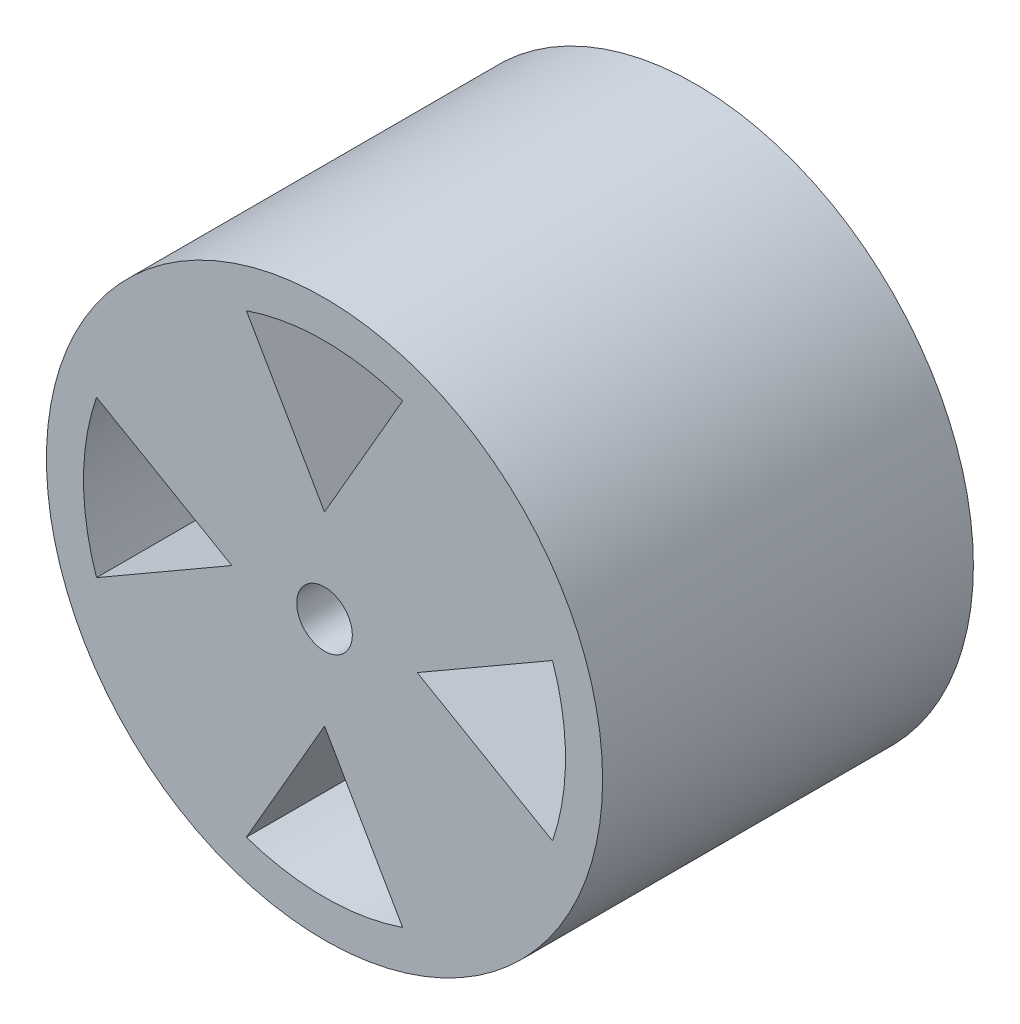
ISO-10303-21;
HEADER;
FILE_DESCRIPTION(('STEP AP214'),'2;1');
FILE_NAME('part.step','',(''),(''),'','','');
FILE_SCHEMA(('AUTOMOTIVE_DESIGN { 1 0 10303 214 1 1 1 1 }'));
ENDSEC;
DATA;
#1=APPLICATION_CONTEXT('core data for automotive mechanical design processes');
#2=APPLICATION_PROTOCOL_DEFINITION('international standard','automotive_design',2000,#1);
#3=PRODUCT_CONTEXT('',#1,'mechanical');
#4=PRODUCT('Part','Part','',(#3));
#5=PRODUCT_RELATED_PRODUCT_CATEGORY('part','',(#4));
#6=PRODUCT_DEFINITION_FORMATION('','',#4);
#7=PRODUCT_DEFINITION_CONTEXT('part definition',#1,'design');
#8=PRODUCT_DEFINITION('design','',#6,#7);
#9=PRODUCT_DEFINITION_SHAPE('','',#8);
#10=(LENGTH_UNIT() NAMED_UNIT(*) SI_UNIT(.MILLI.,.METRE.));
#11=(NAMED_UNIT(*) PLANE_ANGLE_UNIT() SI_UNIT($,.RADIAN.));
#12=(NAMED_UNIT(*) SI_UNIT($,.STERADIAN.) SOLID_ANGLE_UNIT());
#13=UNCERTAINTY_MEASURE_WITH_UNIT(LENGTH_MEASURE(1.E-05),#10,'distance_accuracy_value','');
#14=(GEOMETRIC_REPRESENTATION_CONTEXT(3) GLOBAL_UNCERTAINTY_ASSIGNED_CONTEXT((#13)) GLOBAL_UNIT_ASSIGNED_CONTEXT((#10,
#11,#12)) REPRESENTATION_CONTEXT('',''));
#15=CARTESIAN_POINT('',(0.,0.,0.));
#16=DIRECTION('',(0.,0.,1.));
#17=DIRECTION('',(1.,0.,0.));
#18=AXIS2_PLACEMENT_3D('',#15,#16,#17);
#19=CARTESIAN_POINT('',(0.,0.,10.));
#20=DIRECTION('',(0.,0.,1.));
#21=DIRECTION('',(1.,0.,0.));
#22=AXIS2_PLACEMENT_3D('',#19,#20,#21);
#23=PLANE('',#22);
#24=DIRECTION('',(-0.866025403784438,0.500000000000001,0.));
#25=VECTOR('',#24,1.);
#26=CARTESIAN_POINT('',(-0.625000000000002,-1.08253175473055,10.));
#27=LINE('',#26,#25);
#28=CARTESIAN_POINT('',(-2.5,0.,10.));
#29=VERTEX_POINT('',#28);
#30=CARTESIAN_POINT('',(-6.14909494849609,2.10680595081272,10.));
#31=VERTEX_POINT('',#30);
#32=EDGE_CURVE('E56',#29,#31,#27,.T.);
#33=ORIENTED_EDGE('',*,*,#32,.F.);
#34=DIRECTION('',(-0.866025403784438,-0.500000000000002,0.));
#35=VECTOR('',#34,1.);
#36=CARTESIAN_POINT('',(-0.625000000000004,1.08253175473055,10.));
#37=LINE('',#36,#35);
#38=CARTESIAN_POINT('',(-6.14909494849609,-2.10680595081273,10.));
#39=VERTEX_POINT('',#38);
#40=EDGE_CURVE('E151',#29,#39,#37,.T.);
#41=ORIENTED_EDGE('',*,*,#40,.T.);
#42=CARTESIAN_POINT('',(0.,0.,10.));
#43=DIRECTION('',(0.,0.,1.));
#44=DIRECTION('',(1.,0.,0.));
#45=AXIS2_PLACEMENT_3D('',#42,#43,#44);
#46=CIRCLE('',#45,6.5);
#47=EDGE_CURVE('E156',#31,#39,#46,.T.);
#48=ORIENTED_EDGE('',*,*,#47,.F.);
#49=EDGE_LOOP('',(#33,#41,#48));
#50=FACE_BOUND('',#49,.T.);
#51=DIRECTION('',(0.866025403784438,-0.500000000000001,0.));
#52=VECTOR('',#51,1.);
#53=CARTESIAN_POINT('',(0.625000000000002,1.08253175473055,10.));
#54=LINE('',#53,#52);
#55=CARTESIAN_POINT('',(2.5,0.,10.));
#56=VERTEX_POINT('',#55);
#57=CARTESIAN_POINT('',(6.14909494849609,-2.10680595081272,10.));
#58=VERTEX_POINT('',#57);
#59=EDGE_CURVE('E64',#56,#58,#54,.T.);
#60=ORIENTED_EDGE('',*,*,#59,.F.);
#61=DIRECTION('',(0.866025403784438,0.500000000000002,0.));
#62=VECTOR('',#61,1.);
#63=CARTESIAN_POINT('',(0.625000000000004,-1.08253175473055,10.));
#64=LINE('',#63,#62);
#65=CARTESIAN_POINT('',(6.14909494849609,2.10680595081273,10.));
#66=VERTEX_POINT('',#65);
#67=EDGE_CURVE('E177',#56,#66,#64,.T.);
#68=ORIENTED_EDGE('',*,*,#67,.T.);
#69=CARTESIAN_POINT('',(0.,0.,10.));
#70=DIRECTION('',(0.,0.,1.));
#71=DIRECTION('',(1.,0.,0.));
#72=AXIS2_PLACEMENT_3D('',#69,#70,#71);
#73=CIRCLE('',#72,6.5);
#74=EDGE_CURVE('E188',#58,#66,#73,.T.);
#75=ORIENTED_EDGE('',*,*,#74,.F.);
#76=EDGE_LOOP('',(#60,#68,#75));
#77=FACE_BOUND('',#76,.T.);
#78=CARTESIAN_POINT('',(0.,0.,10.));
#79=DIRECTION('',(0.,0.,1.));
#80=DIRECTION('',(1.,0.,0.));
#81=AXIS2_PLACEMENT_3D('',#78,#79,#80);
#82=CIRCLE('',#81,6.5);
#83=CARTESIAN_POINT('',(-2.10680595081272,-6.14909494849609,10.));
#84=VERTEX_POINT('',#83);
#85=CARTESIAN_POINT('',(2.10680595081273,-6.14909494849609,10.));
#86=VERTEX_POINT('',#85);
#87=EDGE_CURVE('E216',#84,#86,#82,.T.);
#88=ORIENTED_EDGE('',*,*,#87,.F.);
#89=DIRECTION('',(-0.500000000000001,-0.866025403784438,0.));
#90=VECTOR('',#89,1.);
#91=CARTESIAN_POINT('',(1.08253175473055,-0.625000000000002,10.));
#92=LINE('',#91,#90);
#93=CARTESIAN_POINT('',(0.,-2.5,10.));
#94=VERTEX_POINT('',#93);
#95=EDGE_CURVE('E208',#94,#84,#92,.T.);
#96=ORIENTED_EDGE('',*,*,#95,.F.);
#97=DIRECTION('',(0.500000000000002,-0.866025403784438,0.));
#98=VECTOR('',#97,1.);
#99=CARTESIAN_POINT('',(-1.08253175473055,-0.625000000000004,10.));
#100=LINE('',#99,#98);
#101=EDGE_CURVE('E219',#94,#86,#100,.T.);
#102=ORIENTED_EDGE('',*,*,#101,.T.);
#103=EDGE_LOOP('',(#88,#96,#102));
#104=FACE_BOUND('',#103,.T.);
#105=DIRECTION('',(0.500000000000001,0.866025403784438,0.));
#106=VECTOR('',#105,1.);
#107=CARTESIAN_POINT('',(-1.08253175473055,0.625000000000002,10.));
#108=LINE('',#107,#106);
#109=CARTESIAN_POINT('',(0.,2.5,10.));
#110=VERTEX_POINT('',#109);
#111=CARTESIAN_POINT('',(2.10680595081272,6.14909494849609,10.));
#112=VERTEX_POINT('',#111);
#113=EDGE_CURVE('E249',#110,#112,#108,.T.);
#114=ORIENTED_EDGE('',*,*,#113,.F.);
#115=DIRECTION('',(-0.500000000000002,0.866025403784438,0.));
#116=VECTOR('',#115,1.);
#117=CARTESIAN_POINT('',(1.08253175473055,0.625000000000004,10.));
#118=LINE('',#117,#116);
#119=CARTESIAN_POINT('',(-2.10680595081273,6.14909494849609,10.));
#120=VERTEX_POINT('',#119);
#121=EDGE_CURVE('E240',#110,#120,#118,.T.);
#122=ORIENTED_EDGE('',*,*,#121,.T.);
#123=CARTESIAN_POINT('',(0.,0.,10.));
#124=DIRECTION('',(0.,0.,1.));
#125=DIRECTION('',(1.,0.,0.));
#126=AXIS2_PLACEMENT_3D('',#123,#124,#125);
#127=CIRCLE('',#126,6.5);
#128=EDGE_CURVE('E252',#112,#120,#127,.T.);
#129=ORIENTED_EDGE('',*,*,#128,.F.);
#130=EDGE_LOOP('',(#114,#122,#129));
#131=FACE_BOUND('',#130,.T.);
#132=CARTESIAN_POINT('',(0.,0.,10.));
#133=DIRECTION('',(0.,0.,1.));
#134=DIRECTION('',(1.,0.,0.));
#135=AXIS2_PLACEMENT_3D('',#132,#133,#134);
#136=CIRCLE('',#135,7.5);
#137=CARTESIAN_POINT('',(7.5,0.,10.));
#138=VERTEX_POINT('',#137);
#139=EDGE_CURVE('E11',#138,#138,#136,.T.);
#140=ORIENTED_EDGE('',*,*,#139,.T.);
#141=EDGE_LOOP('',(#140));
#142=FACE_BOUND('',#141,.T.);
#143=CARTESIAN_POINT('',(0.,0.,10.));
#144=DIRECTION('',(0.,0.,1.));
#145=DIRECTION('',(1.,0.,0.));
#146=AXIS2_PLACEMENT_3D('',#143,#144,#145);
#147=CIRCLE('',#146,0.75);
#148=CARTESIAN_POINT('',(0.75,0.,10.));
#149=VERTEX_POINT('',#148);
#150=EDGE_CURVE('E267',#149,#149,#147,.T.);
#151=ORIENTED_EDGE('',*,*,#150,.F.);
#152=EDGE_LOOP('',(#151));
#153=FACE_BOUND('',#152,.T.);
#154=ADVANCED_FACE('F40',(#50,#77,#104,#131,#142,#153),#23,.T.);
#155=CARTESIAN_POINT('',(0.,0.,0.));
#156=DIRECTION('',(0.,0.,1.));
#157=DIRECTION('',(1.,0.,0.));
#158=AXIS2_PLACEMENT_3D('',#155,#156,#157);
#159=PLANE('',#158);
#160=DIRECTION('',(-0.866025403784438,-0.500000000000002,0.));
#161=VECTOR('',#160,1.);
#162=CARTESIAN_POINT('',(-0.625000000000004,1.08253175473055,0.));
#163=LINE('',#162,#161);
#164=CARTESIAN_POINT('',(-2.5,0.,0.));
#165=VERTEX_POINT('',#164);
#166=CARTESIAN_POINT('',(-6.14909494849609,-2.10680595081273,0.));
#167=VERTEX_POINT('',#166);
#168=EDGE_CURVE('E139',#165,#167,#163,.T.);
#169=ORIENTED_EDGE('',*,*,#168,.F.);
#170=DIRECTION('',(-0.866025403784438,0.500000000000001,0.));
#171=VECTOR('',#170,1.);
#172=CARTESIAN_POINT('',(-0.625000000000002,-1.08253175473055,0.));
#173=LINE('',#172,#171);
#174=CARTESIAN_POINT('',(-6.14909494849608,2.10680595081272,0.));
#175=VERTEX_POINT('',#174);
#176=EDGE_CURVE('E132',#165,#175,#173,.T.);
#177=ORIENTED_EDGE('',*,*,#176,.T.);
#178=CARTESIAN_POINT('',(0.,0.,0.));
#179=DIRECTION('',(0.,0.,1.));
#180=DIRECTION('',(1.,0.,0.));
#181=AXIS2_PLACEMENT_3D('',#178,#179,#180);
#182=CIRCLE('',#181,6.5);
#183=EDGE_CURVE('E142',#175,#167,#182,.T.);
#184=ORIENTED_EDGE('',*,*,#183,.T.);
#185=EDGE_LOOP('',(#169,#177,#184));
#186=FACE_BOUND('',#185,.T.);
#187=DIRECTION('',(0.866025403784438,0.500000000000002,0.));
#188=VECTOR('',#187,1.);
#189=CARTESIAN_POINT('',(0.625000000000004,-1.08253175473055,0.));
#190=LINE('',#189,#188);
#191=CARTESIAN_POINT('',(2.5,0.,0.));
#192=VERTEX_POINT('',#191);
#193=CARTESIAN_POINT('',(6.14909494849609,2.10680595081273,0.));
#194=VERTEX_POINT('',#193);
#195=EDGE_CURVE('E181',#192,#194,#190,.T.);
#196=ORIENTED_EDGE('',*,*,#195,.F.);
#197=DIRECTION('',(0.866025403784438,-0.500000000000001,0.));
#198=VECTOR('',#197,1.);
#199=CARTESIAN_POINT('',(0.625000000000002,1.08253175473055,0.));
#200=LINE('',#199,#198);
#201=CARTESIAN_POINT('',(6.14909494849608,-2.10680595081272,0.));
#202=VERTEX_POINT('',#201);
#203=EDGE_CURVE('E172',#192,#202,#200,.T.);
#204=ORIENTED_EDGE('',*,*,#203,.T.);
#205=CARTESIAN_POINT('',(0.,0.,0.));
#206=DIRECTION('',(0.,0.,1.));
#207=DIRECTION('',(1.,0.,0.));
#208=AXIS2_PLACEMENT_3D('',#205,#206,#207);
#209=CIRCLE('',#208,6.5);
#210=EDGE_CURVE('E176',#202,#194,#209,.T.);
#211=ORIENTED_EDGE('',*,*,#210,.T.);
#212=EDGE_LOOP('',(#196,#204,#211));
#213=FACE_BOUND('',#212,.T.);
#214=DIRECTION('',(-0.500000000000001,-0.866025403784438,0.));
#215=VECTOR('',#214,1.);
#216=CARTESIAN_POINT('',(1.08253175473055,-0.625000000000002,0.));
#217=LINE('',#216,#215);
#218=CARTESIAN_POINT('',(0.,-2.5,0.));
#219=VERTEX_POINT('',#218);
#220=CARTESIAN_POINT('',(-2.10680595081272,-6.14909494849609,0.));
#221=VERTEX_POINT('',#220);
#222=EDGE_CURVE('E211',#219,#221,#217,.T.);
#223=ORIENTED_EDGE('',*,*,#222,.T.);
#224=CARTESIAN_POINT('',(0.,0.,0.));
#225=DIRECTION('',(0.,0.,1.));
#226=DIRECTION('',(1.,0.,0.));
#227=AXIS2_PLACEMENT_3D('',#224,#225,#226);
#228=CIRCLE('',#227,6.5);
#229=CARTESIAN_POINT('',(2.10680595081273,-6.14909494849609,0.));
#230=VERTEX_POINT('',#229);
#231=EDGE_CURVE('E203',#221,#230,#228,.T.);
#232=ORIENTED_EDGE('',*,*,#231,.T.);
#233=DIRECTION('',(0.500000000000002,-0.866025403784438,0.));
#234=VECTOR('',#233,1.);
#235=CARTESIAN_POINT('',(-1.08253175473055,-0.625000000000004,0.));
#236=LINE('',#235,#234);
#237=EDGE_CURVE('E207',#219,#230,#236,.T.);
#238=ORIENTED_EDGE('',*,*,#237,.F.);
#239=EDGE_LOOP('',(#223,#232,#238));
#240=FACE_BOUND('',#239,.T.);
#241=DIRECTION('',(-0.500000000000002,0.866025403784438,0.));
#242=VECTOR('',#241,1.);
#243=CARTESIAN_POINT('',(1.08253175473055,0.625000000000004,0.));
#244=LINE('',#243,#242);
#245=CARTESIAN_POINT('',(0.,2.5,0.));
#246=VERTEX_POINT('',#245);
#247=CARTESIAN_POINT('',(-2.10680595081273,6.14909494849609,0.));
#248=VERTEX_POINT('',#247);
#249=EDGE_CURVE('E244',#246,#248,#244,.T.);
#250=ORIENTED_EDGE('',*,*,#249,.F.);
#251=DIRECTION('',(0.500000000000001,0.866025403784438,0.));
#252=VECTOR('',#251,1.);
#253=CARTESIAN_POINT('',(-1.08253175473055,0.625000000000002,0.));
#254=LINE('',#253,#252);
#255=CARTESIAN_POINT('',(2.10680595081272,6.14909494849608,0.));
#256=VERTEX_POINT('',#255);
#257=EDGE_CURVE('E235',#246,#256,#254,.T.);
#258=ORIENTED_EDGE('',*,*,#257,.T.);
#259=CARTESIAN_POINT('',(0.,0.,0.));
#260=DIRECTION('',(0.,0.,1.));
#261=DIRECTION('',(1.,0.,0.));
#262=AXIS2_PLACEMENT_3D('',#259,#260,#261);
#263=CIRCLE('',#262,6.5);
#264=EDGE_CURVE('E239',#256,#248,#263,.T.);
#265=ORIENTED_EDGE('',*,*,#264,.T.);
#266=EDGE_LOOP('',(#250,#258,#265));
#267=FACE_BOUND('',#266,.T.);
#268=CARTESIAN_POINT('',(0.,0.,0.));
#269=DIRECTION('',(0.,0.,1.));
#270=DIRECTION('',(1.,0.,0.));
#271=AXIS2_PLACEMENT_3D('',#268,#269,#270);
#272=CIRCLE('',#271,7.5);
#273=CARTESIAN_POINT('',(7.5,0.,0.));
#274=VERTEX_POINT('',#273);
#275=EDGE_CURVE('E44',#274,#274,#272,.T.);
#276=ORIENTED_EDGE('',*,*,#275,.F.);
#277=EDGE_LOOP('',(#276));
#278=FACE_BOUND('',#277,.T.);
#279=CARTESIAN_POINT('',(0.,0.,0.));
#280=DIRECTION('',(0.,0.,1.));
#281=DIRECTION('',(1.,0.,0.));
#282=AXIS2_PLACEMENT_3D('',#279,#280,#281);
#283=CIRCLE('',#282,0.75);
#284=CARTESIAN_POINT('',(0.75,0.,0.));
#285=VERTEX_POINT('',#284);
#286=EDGE_CURVE('E169',#285,#285,#283,.T.);
#287=ORIENTED_EDGE('',*,*,#286,.T.);
#288=EDGE_LOOP('',(#287));
#289=FACE_BOUND('',#288,.T.);
#290=ADVANCED_FACE('F148',(#186,#213,#240,#267,#278,#289),#159,.F.);
#291=CARTESIAN_POINT('',(0.,0.,10.));
#292=DIRECTION('',(0.,0.,-1.));
#293=DIRECTION('',(-1.,0.,0.));
#294=AXIS2_PLACEMENT_3D('',#291,#292,#293);
#295=CYLINDRICAL_SURFACE('',#294,7.5);
#296=ORIENTED_EDGE('',*,*,#139,.F.);
#297=EDGE_LOOP('',(#296));
#298=FACE_BOUND('',#297,.T.);
#299=ORIENTED_EDGE('',*,*,#275,.T.);
#300=EDGE_LOOP('',(#299));
#301=FACE_BOUND('',#300,.T.);
#302=ADVANCED_FACE('F42',(#298,#301),#295,.T.);
#303=CARTESIAN_POINT('',(0.,0.,10.));
#304=DIRECTION('',(0.,0.,-1.));
#305=DIRECTION('',(-1.,0.,0.));
#306=AXIS2_PLACEMENT_3D('',#303,#304,#305);
#307=CYLINDRICAL_SURFACE('',#306,0.75);
#308=ORIENTED_EDGE('',*,*,#150,.T.);
#309=EDGE_LOOP('',(#308));
#310=FACE_BOUND('',#309,.T.);
#311=ORIENTED_EDGE('',*,*,#286,.F.);
#312=EDGE_LOOP('',(#311));
#313=FACE_BOUND('',#312,.T.);
#314=ADVANCED_FACE('F277',(#310,#313),#307,.F.);
#315=CARTESIAN_POINT('',(-1.08253175473055,0.625000000000002,0.));
#316=DIRECTION('',(0.866025403784438,-0.500000000000001,0.));
#317=DIRECTION('',(0.500000000000001,0.866025403784438,0.));
#318=AXIS2_PLACEMENT_3D('',#315,#316,#317);
#319=PLANE('',#318);
#320=ORIENTED_EDGE('',*,*,#113,.T.);
#321=DIRECTION('',(0.,0.,1.));
#322=VECTOR('',#321,1.);
#323=CARTESIAN_POINT('',(2.10680595081272,6.14909494849608,0.));
#324=LINE('',#323,#322);
#325=EDGE_CURVE('E248',#256,#112,#324,.T.);
#326=ORIENTED_EDGE('',*,*,#325,.F.);
#327=ORIENTED_EDGE('',*,*,#257,.F.);
#328=DIRECTION('',(0.,0.,1.));
#329=VECTOR('',#328,1.);
#330=CARTESIAN_POINT('',(0.,2.5,0.));
#331=LINE('',#330,#329);
#332=EDGE_CURVE('E220',#246,#110,#331,.T.);
#333=ORIENTED_EDGE('',*,*,#332,.T.);
#334=EDGE_LOOP('',(#320,#326,#327,#333));
#335=FACE_BOUND('',#334,.T.);
#336=ADVANCED_FACE('F279',(#335),#319,.F.);
#337=CARTESIAN_POINT('',(1.08253175473055,0.625000000000004,0.));
#338=DIRECTION('',(0.866025403784438,0.500000000000002,0.));
#339=DIRECTION('',(-0.500000000000002,0.866025403784438,0.));
#340=AXIS2_PLACEMENT_3D('',#337,#338,#339);
#341=PLANE('',#340);
#342=ORIENTED_EDGE('',*,*,#121,.F.);
#343=ORIENTED_EDGE('',*,*,#332,.F.);
#344=ORIENTED_EDGE('',*,*,#249,.T.);
#345=DIRECTION('',(0.,0.,1.));
#346=VECTOR('',#345,1.);
#347=CARTESIAN_POINT('',(-2.10680595081273,6.14909494849609,0.));
#348=LINE('',#347,#346);
#349=EDGE_CURVE('E261',#248,#120,#348,.T.);
#350=ORIENTED_EDGE('',*,*,#349,.T.);
#351=EDGE_LOOP('',(#342,#343,#344,#350));
#352=FACE_BOUND('',#351,.T.);
#353=ADVANCED_FACE('F286',(#352),#341,.T.);
#354=CARTESIAN_POINT('',(0.,0.,0.));
#355=DIRECTION('',(0.,0.,1.));
#356=DIRECTION('',(1.,0.,0.));
#357=AXIS2_PLACEMENT_3D('',#354,#355,#356);
#358=CYLINDRICAL_SURFACE('',#357,6.5);
#359=ORIENTED_EDGE('',*,*,#128,.T.);
#360=ORIENTED_EDGE('',*,*,#349,.F.);
#361=ORIENTED_EDGE('',*,*,#264,.F.);
#362=ORIENTED_EDGE('',*,*,#325,.T.);
#363=EDGE_LOOP('',(#359,#360,#361,#362));
#364=FACE_BOUND('',#363,.T.);
#365=ADVANCED_FACE('F320',(#364),#358,.F.);
#366=CARTESIAN_POINT('',(0.,0.,0.));
#367=DIRECTION('',(0.,0.,1.));
#368=DIRECTION('',(1.,0.,0.));
#369=AXIS2_PLACEMENT_3D('',#366,#367,#368);
#370=CYLINDRICAL_SURFACE('',#369,6.5);
#371=ORIENTED_EDGE('',*,*,#87,.T.);
#372=DIRECTION('',(0.,0.,1.));
#373=VECTOR('',#372,1.);
#374=CARTESIAN_POINT('',(2.10680595081273,-6.14909494849609,0.));
#375=LINE('',#374,#373);
#376=EDGE_CURVE('E215',#230,#86,#375,.T.);
#377=ORIENTED_EDGE('',*,*,#376,.F.);
#378=ORIENTED_EDGE('',*,*,#231,.F.);
#379=DIRECTION('',(0.,0.,1.));
#380=VECTOR('',#379,1.);
#381=CARTESIAN_POINT('',(-2.10680595081272,-6.14909494849609,0.));
#382=LINE('',#381,#380);
#383=EDGE_CURVE('E189',#221,#84,#382,.T.);
#384=ORIENTED_EDGE('',*,*,#383,.T.);
#385=EDGE_LOOP('',(#371,#377,#378,#384));
#386=FACE_BOUND('',#385,.T.);
#387=ADVANCED_FACE('F329',(#386),#370,.F.);
#388=CARTESIAN_POINT('',(1.08253175473055,-0.625000000000002,0.));
#389=DIRECTION('',(-0.866025403784438,0.500000000000001,0.));
#390=DIRECTION('',(-0.500000000000001,-0.866025403784438,0.));
#391=AXIS2_PLACEMENT_3D('',#388,#389,#390);
#392=PLANE('',#391);
#393=ORIENTED_EDGE('',*,*,#95,.T.);
#394=ORIENTED_EDGE('',*,*,#383,.F.);
#395=ORIENTED_EDGE('',*,*,#222,.F.);
#396=DIRECTION('',(0.,0.,1.));
#397=VECTOR('',#396,1.);
#398=CARTESIAN_POINT('',(0.,-2.5,0.));
#399=LINE('',#398,#397);
#400=EDGE_CURVE('E229',#219,#94,#399,.T.);
#401=ORIENTED_EDGE('',*,*,#400,.T.);
#402=EDGE_LOOP('',(#393,#394,#395,#401));
#403=FACE_BOUND('',#402,.T.);
#404=ADVANCED_FACE('F334',(#403),#392,.F.);
#405=CARTESIAN_POINT('',(-1.08253175473055,-0.625000000000004,0.));
#406=DIRECTION('',(-0.866025403784438,-0.500000000000002,0.));
#407=DIRECTION('',(0.500000000000002,-0.866025403784438,0.));
#408=AXIS2_PLACEMENT_3D('',#405,#406,#407);
#409=PLANE('',#408);
#410=ORIENTED_EDGE('',*,*,#101,.F.);
#411=ORIENTED_EDGE('',*,*,#400,.F.);
#412=ORIENTED_EDGE('',*,*,#237,.T.);
#413=ORIENTED_EDGE('',*,*,#376,.T.);
#414=EDGE_LOOP('',(#410,#411,#412,#413));
#415=FACE_BOUND('',#414,.T.);
#416=ADVANCED_FACE('F336',(#415),#409,.T.);
#417=CARTESIAN_POINT('',(0.625000000000002,1.08253175473055,0.));
#418=DIRECTION('',(-0.500000000000001,-0.866025403784438,0.));
#419=DIRECTION('',(0.866025403784438,-0.500000000000001,0.));
#420=AXIS2_PLACEMENT_3D('',#417,#418,#419);
#421=PLANE('',#420);
#422=ORIENTED_EDGE('',*,*,#59,.T.);
#423=DIRECTION('',(0.,0.,1.));
#424=VECTOR('',#423,1.);
#425=CARTESIAN_POINT('',(6.14909494849608,-2.10680595081272,0.));
#426=LINE('',#425,#424);
#427=EDGE_CURVE('E185',#202,#58,#426,.T.);
#428=ORIENTED_EDGE('',*,*,#427,.F.);
#429=ORIENTED_EDGE('',*,*,#203,.F.);
#430=DIRECTION('',(0.,0.,1.));
#431=VECTOR('',#430,1.);
#432=CARTESIAN_POINT('',(2.5,0.,0.));
#433=LINE('',#432,#431);
#434=EDGE_CURVE('E163',#192,#56,#433,.T.);
#435=ORIENTED_EDGE('',*,*,#434,.T.);
#436=EDGE_LOOP('',(#422,#428,#429,#435));
#437=FACE_BOUND('',#436,.T.);
#438=ADVANCED_FACE('F339',(#437),#421,.F.);
#439=CARTESIAN_POINT('',(0.625000000000004,-1.08253175473055,0.));
#440=DIRECTION('',(0.500000000000002,-0.866025403784438,0.));
#441=DIRECTION('',(0.866025403784438,0.500000000000002,0.));
#442=AXIS2_PLACEMENT_3D('',#439,#440,#441);
#443=PLANE('',#442);
#444=ORIENTED_EDGE('',*,*,#67,.F.);
#445=ORIENTED_EDGE('',*,*,#434,.F.);
#446=ORIENTED_EDGE('',*,*,#195,.T.);
#447=DIRECTION('',(0.,0.,1.));
#448=VECTOR('',#447,1.);
#449=CARTESIAN_POINT('',(6.14909494849609,2.10680595081273,0.));
#450=LINE('',#449,#448);
#451=EDGE_CURVE('E198',#194,#66,#450,.T.);
#452=ORIENTED_EDGE('',*,*,#451,.T.);
#453=EDGE_LOOP('',(#444,#445,#446,#452));
#454=FACE_BOUND('',#453,.T.);
#455=ADVANCED_FACE('F346',(#454),#443,.T.);
#456=CARTESIAN_POINT('',(0.,0.,0.));
#457=DIRECTION('',(0.,0.,1.));
#458=DIRECTION('',(1.,0.,0.));
#459=AXIS2_PLACEMENT_3D('',#456,#457,#458);
#460=CYLINDRICAL_SURFACE('',#459,6.5);
#461=ORIENTED_EDGE('',*,*,#74,.T.);
#462=ORIENTED_EDGE('',*,*,#451,.F.);
#463=ORIENTED_EDGE('',*,*,#210,.F.);
#464=ORIENTED_EDGE('',*,*,#427,.T.);
#465=EDGE_LOOP('',(#461,#462,#463,#464));
#466=FACE_BOUND('',#465,.T.);
#467=ADVANCED_FACE('F347',(#466),#460,.F.);
#468=CARTESIAN_POINT('',(-0.625000000000002,-1.08253175473055,0.));
#469=DIRECTION('',(0.500000000000001,0.866025403784438,0.));
#470=DIRECTION('',(-0.866025403784438,0.500000000000001,0.));
#471=AXIS2_PLACEMENT_3D('',#468,#469,#470);
#472=PLANE('',#471);
#473=ORIENTED_EDGE('',*,*,#32,.T.);
#474=DIRECTION('',(0.,0.,1.));
#475=VECTOR('',#474,1.);
#476=CARTESIAN_POINT('',(-6.14909494849608,2.10680595081272,0.));
#477=LINE('',#476,#475);
#478=EDGE_CURVE('E128',#175,#31,#477,.T.);
#479=ORIENTED_EDGE('',*,*,#478,.F.);
#480=ORIENTED_EDGE('',*,*,#176,.F.);
#481=DIRECTION('',(0.,0.,1.));
#482=VECTOR('',#481,1.);
#483=CARTESIAN_POINT('',(-2.5,0.,0.));
#484=LINE('',#483,#482);
#485=EDGE_CURVE('E166',#165,#29,#484,.T.);
#486=ORIENTED_EDGE('',*,*,#485,.T.);
#487=EDGE_LOOP('',(#473,#479,#480,#486));
#488=FACE_BOUND('',#487,.T.);
#489=ADVANCED_FACE('F130',(#488),#472,.F.);
#490=CARTESIAN_POINT('',(-0.625000000000004,1.08253175473055,0.));
#491=DIRECTION('',(-0.500000000000002,0.866025403784438,0.));
#492=DIRECTION('',(-0.866025403784438,-0.500000000000002,0.));
#493=AXIS2_PLACEMENT_3D('',#490,#491,#492);
#494=PLANE('',#493);
#495=ORIENTED_EDGE('',*,*,#40,.F.);
#496=ORIENTED_EDGE('',*,*,#485,.F.);
#497=ORIENTED_EDGE('',*,*,#168,.T.);
#498=DIRECTION('',(0.,0.,1.));
#499=VECTOR('',#498,1.);
#500=CARTESIAN_POINT('',(-6.14909494849609,-2.10680595081273,0.));
#501=LINE('',#500,#499);
#502=EDGE_CURVE('E138',#167,#39,#501,.T.);
#503=ORIENTED_EDGE('',*,*,#502,.T.);
#504=EDGE_LOOP('',(#495,#496,#497,#503));
#505=FACE_BOUND('',#504,.T.);
#506=ADVANCED_FACE('F356',(#505),#494,.T.);
#507=CARTESIAN_POINT('',(0.,0.,0.));
#508=DIRECTION('',(0.,0.,1.));
#509=DIRECTION('',(1.,0.,0.));
#510=AXIS2_PLACEMENT_3D('',#507,#508,#509);
#511=CYLINDRICAL_SURFACE('',#510,6.5);
#512=ORIENTED_EDGE('',*,*,#47,.T.);
#513=ORIENTED_EDGE('',*,*,#502,.F.);
#514=ORIENTED_EDGE('',*,*,#183,.F.);
#515=ORIENTED_EDGE('',*,*,#478,.T.);
#516=EDGE_LOOP('',(#512,#513,#514,#515));
#517=FACE_BOUND('',#516,.T.);
#518=ADVANCED_FACE('F143',(#517),#511,.F.);
#519=CLOSED_SHELL('',(#154,#290,#302,#314,#336,#353,#365,#387,#404,#416,#438,#455,#467,#489,
#506,#518));
#520=MANIFOLD_SOLID_BREP('B2',#519);
#521=ADVANCED_BREP_SHAPE_REPRESENTATION('',(#18,#520),#14);
#522=SHAPE_DEFINITION_REPRESENTATION(#9,#521);
ENDSEC;
END-ISO-10303-21;
